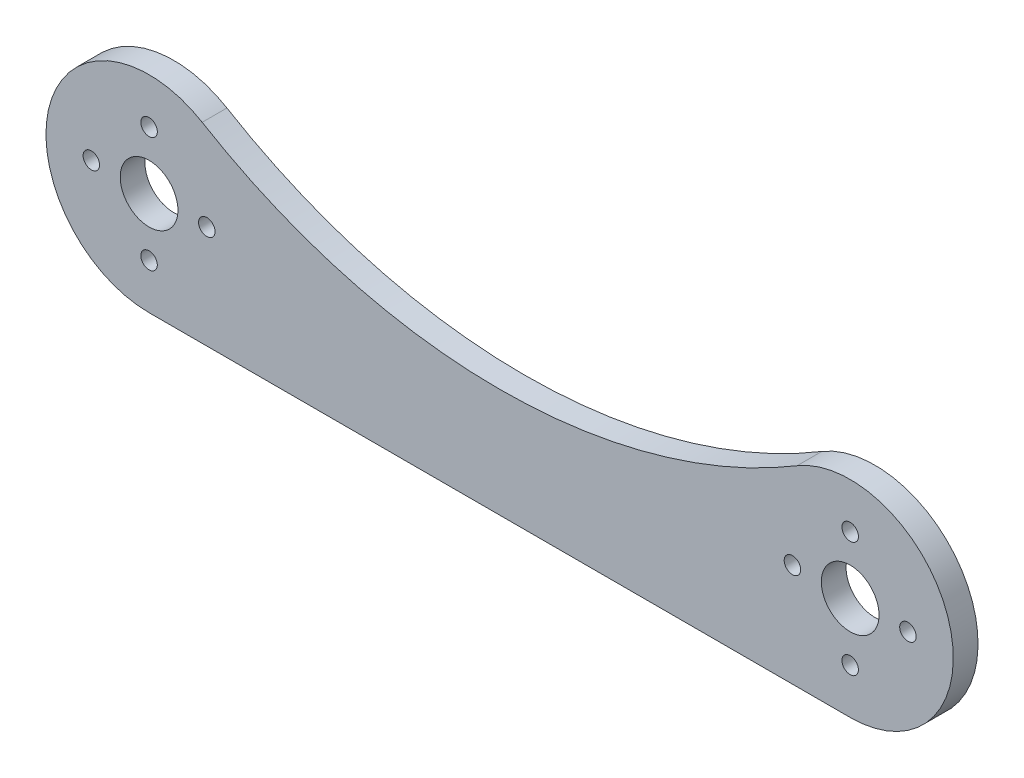
ISO-10303-21;
HEADER;
FILE_DESCRIPTION(('STEP AP214'),'2;1');
FILE_NAME('part.step','',(''),(''),'','','');
FILE_SCHEMA(('AUTOMOTIVE_DESIGN { 1 0 10303 214 1 1 1 1 }'));
ENDSEC;
DATA;
#1=APPLICATION_CONTEXT('core data for automotive mechanical design processes');
#2=APPLICATION_PROTOCOL_DEFINITION('international standard','automotive_design',2000,#1);
#3=PRODUCT_CONTEXT('',#1,'mechanical');
#4=PRODUCT('Part','Part','',(#3));
#5=PRODUCT_RELATED_PRODUCT_CATEGORY('part','',(#4));
#6=PRODUCT_DEFINITION_FORMATION('','',#4);
#7=PRODUCT_DEFINITION_CONTEXT('part definition',#1,'design');
#8=PRODUCT_DEFINITION('design','',#6,#7);
#9=PRODUCT_DEFINITION_SHAPE('','',#8);
#10=(LENGTH_UNIT() NAMED_UNIT(*) SI_UNIT(.MILLI.,.METRE.));
#11=(NAMED_UNIT(*) PLANE_ANGLE_UNIT() SI_UNIT($,.RADIAN.));
#12=(NAMED_UNIT(*) SI_UNIT($,.STERADIAN.) SOLID_ANGLE_UNIT());
#13=UNCERTAINTY_MEASURE_WITH_UNIT(LENGTH_MEASURE(1.E-05),#10,'distance_accuracy_value','');
#14=(GEOMETRIC_REPRESENTATION_CONTEXT(3) GLOBAL_UNCERTAINTY_ASSIGNED_CONTEXT((#13)) GLOBAL_UNIT_ASSIGNED_CONTEXT((#10,
#11,#12)) REPRESENTATION_CONTEXT('',''));
#15=CARTESIAN_POINT('',(0.,0.,0.));
#16=DIRECTION('',(0.,0.,1.));
#17=DIRECTION('',(1.,0.,0.));
#18=AXIS2_PLACEMENT_3D('',#15,#16,#17);
#19=CARTESIAN_POINT('',(-42.5,0.,3.));
#20=DIRECTION('',(0.,0.,1.));
#21=DIRECTION('',(1.,0.,0.));
#22=AXIS2_PLACEMENT_3D('',#19,#20,#21);
#23=PLANE('',#22);
#24=CARTESIAN_POINT('',(42.5,-6.99999999999999,3.));
#25=DIRECTION('',(0.,0.,1.));
#26=DIRECTION('',(1.,0.,0.));
#27=AXIS2_PLACEMENT_3D('',#24,#25,#26);
#28=CIRCLE('',#27,0.999999999999998);
#29=CARTESIAN_POINT('',(43.5,-6.99999999999999,3.));
#30=VERTEX_POINT('',#29);
#31=EDGE_CURVE('E158',#30,#30,#28,.T.);
#32=ORIENTED_EDGE('',*,*,#31,.F.);
#33=EDGE_LOOP('',(#32));
#34=FACE_BOUND('',#33,.T.);
#35=CARTESIAN_POINT('',(42.5,6.99999999999999,3.));
#36=DIRECTION('',(0.,0.,1.));
#37=DIRECTION('',(-1.,0.,0.));
#38=AXIS2_PLACEMENT_3D('',#35,#36,#37);
#39=CIRCLE('',#38,0.999999999999998);
#40=CARTESIAN_POINT('',(41.5,6.99999999999999,3.));
#41=VERTEX_POINT('',#40);
#42=EDGE_CURVE('E146',#41,#41,#39,.T.);
#43=ORIENTED_EDGE('',*,*,#42,.F.);
#44=EDGE_LOOP('',(#43));
#45=FACE_BOUND('',#44,.T.);
#46=CARTESIAN_POINT('',(-42.5,-6.99999999999999,3.));
#47=DIRECTION('',(0.,0.,1.));
#48=DIRECTION('',(-1.,0.,0.));
#49=AXIS2_PLACEMENT_3D('',#46,#47,#48);
#50=CIRCLE('',#49,0.999999999999998);
#51=CARTESIAN_POINT('',(-43.5,-6.99999999999999,3.));
#52=VERTEX_POINT('',#51);
#53=EDGE_CURVE('E134',#52,#52,#50,.T.);
#54=ORIENTED_EDGE('',*,*,#53,.F.);
#55=EDGE_LOOP('',(#54));
#56=FACE_BOUND('',#55,.T.);
#57=CARTESIAN_POINT('',(-42.5,6.99999999999999,3.));
#58=DIRECTION('',(0.,0.,1.));
#59=DIRECTION('',(1.,0.,0.));
#60=AXIS2_PLACEMENT_3D('',#57,#58,#59);
#61=CIRCLE('',#60,0.999999999999998);
#62=CARTESIAN_POINT('',(-41.5,6.99999999999999,3.));
#63=VERTEX_POINT('',#62);
#64=EDGE_CURVE('E122',#63,#63,#61,.T.);
#65=ORIENTED_EDGE('',*,*,#64,.F.);
#66=EDGE_LOOP('',(#65));
#67=FACE_BOUND('',#66,.T.);
#68=CARTESIAN_POINT('',(-42.5,0.,3.));
#69=DIRECTION('',(0.,0.,1.));
#70=DIRECTION('',(1.,0.,0.));
#71=AXIS2_PLACEMENT_3D('',#68,#69,#70);
#72=CIRCLE('',#71,3.5);
#73=CARTESIAN_POINT('',(-39.,0.,3.));
#74=VERTEX_POINT('',#73);
#75=EDGE_CURVE('E101',#74,#74,#72,.T.);
#76=ORIENTED_EDGE('',*,*,#75,.F.);
#77=EDGE_LOOP('',(#76));
#78=FACE_BOUND('',#77,.T.);
#79=CARTESIAN_POINT('',(-42.5,0.,3.));
#80=DIRECTION('',(0.,0.,1.));
#81=DIRECTION('',(1.,0.,0.));
#82=AXIS2_PLACEMENT_3D('',#79,#80,#81);
#83=CIRCLE('',#82,12.5);
#84=CARTESIAN_POINT('',(-36.0606060606061,10.7137391088871,3.));
#85=VERTEX_POINT('',#84);
#86=CARTESIAN_POINT('',(-42.5,-12.5,3.));
#87=VERTEX_POINT('',#86);
#88=EDGE_CURVE('E86',#85,#87,#83,.T.);
#89=ORIENTED_EDGE('',*,*,#88,.T.);
#90=DIRECTION('',(1.,0.,0.));
#91=VECTOR('',#90,1.);
#92=CARTESIAN_POINT('',(-42.5,-12.5,3.));
#93=LINE('',#92,#91);
#94=CARTESIAN_POINT('',(42.5,-12.5,3.));
#95=VERTEX_POINT('',#94);
#96=EDGE_CURVE('E81',#87,#95,#93,.T.);
#97=ORIENTED_EDGE('',*,*,#96,.T.);
#98=CARTESIAN_POINT('',(42.5,0.,3.));
#99=DIRECTION('',(0.,0.,1.));
#100=DIRECTION('',(1.,0.,0.));
#101=AXIS2_PLACEMENT_3D('',#98,#99,#100);
#102=CIRCLE('',#101,12.5);
#103=CARTESIAN_POINT('',(36.0606060606061,10.7137391088871,3.));
#104=VERTEX_POINT('',#103);
#105=EDGE_CURVE('E84',#95,#104,#102,.T.);
#106=ORIENTED_EDGE('',*,*,#105,.T.);
#107=CARTESIAN_POINT('',(0.,70.7106781186548,3.));
#108=DIRECTION('',(0.,0.,-1.));
#109=DIRECTION('',(1.,0.,0.));
#110=AXIS2_PLACEMENT_3D('',#107,#108,#109);
#111=CIRCLE('',#110,70.);
#112=EDGE_CURVE('E51',#104,#85,#111,.T.);
#113=ORIENTED_EDGE('',*,*,#112,.T.);
#114=EDGE_LOOP('',(#89,#97,#106,#113));
#115=FACE_BOUND('',#114,.T.);
#116=CARTESIAN_POINT('',(42.5,0.,3.));
#117=DIRECTION('',(0.,0.,1.));
#118=DIRECTION('',(1.,0.,0.));
#119=AXIS2_PLACEMENT_3D('',#116,#117,#118);
#120=CIRCLE('',#119,3.5);
#121=CARTESIAN_POINT('',(46.,0.,3.));
#122=VERTEX_POINT('',#121);
#123=EDGE_CURVE('E116',#122,#122,#120,.T.);
#124=ORIENTED_EDGE('',*,*,#123,.F.);
#125=EDGE_LOOP('',(#124));
#126=FACE_BOUND('',#125,.T.);
#127=CARTESIAN_POINT('',(-35.5,0.,3.));
#128=DIRECTION('',(0.,0.,1.));
#129=DIRECTION('',(1.,0.,0.));
#130=AXIS2_PLACEMENT_3D('',#127,#128,#129);
#131=CIRCLE('',#130,0.999999999999998);
#132=CARTESIAN_POINT('',(-34.5,0.,3.));
#133=VERTEX_POINT('',#132);
#134=EDGE_CURVE('E128',#133,#133,#131,.T.);
#135=ORIENTED_EDGE('',*,*,#134,.F.);
#136=EDGE_LOOP('',(#135));
#137=FACE_BOUND('',#136,.T.);
#138=CARTESIAN_POINT('',(-49.5,0.,3.));
#139=DIRECTION('',(0.,0.,1.));
#140=DIRECTION('',(-1.,0.,0.));
#141=AXIS2_PLACEMENT_3D('',#138,#139,#140);
#142=CIRCLE('',#141,0.999999999999998);
#143=CARTESIAN_POINT('',(-50.5,0.,3.));
#144=VERTEX_POINT('',#143);
#145=EDGE_CURVE('E140',#144,#144,#142,.T.);
#146=ORIENTED_EDGE('',*,*,#145,.F.);
#147=EDGE_LOOP('',(#146));
#148=FACE_BOUND('',#147,.T.);
#149=CARTESIAN_POINT('',(35.5,0.,3.));
#150=DIRECTION('',(0.,0.,1.));
#151=DIRECTION('',(-1.,0.,0.));
#152=AXIS2_PLACEMENT_3D('',#149,#150,#151);
#153=CIRCLE('',#152,0.999999999999998);
#154=CARTESIAN_POINT('',(34.5,0.,3.));
#155=VERTEX_POINT('',#154);
#156=EDGE_CURVE('E152',#155,#155,#153,.T.);
#157=ORIENTED_EDGE('',*,*,#156,.F.);
#158=EDGE_LOOP('',(#157));
#159=FACE_BOUND('',#158,.T.);
#160=CARTESIAN_POINT('',(49.5,0.,3.));
#161=DIRECTION('',(0.,0.,1.));
#162=DIRECTION('',(1.,0.,0.));
#163=AXIS2_PLACEMENT_3D('',#160,#161,#162);
#164=CIRCLE('',#163,0.999999999999998);
#165=CARTESIAN_POINT('',(50.5,0.,3.));
#166=VERTEX_POINT('',#165);
#167=EDGE_CURVE('E164',#166,#166,#164,.T.);
#168=ORIENTED_EDGE('',*,*,#167,.F.);
#169=EDGE_LOOP('',(#168));
#170=FACE_BOUND('',#169,.T.);
#171=ADVANCED_FACE('F34',(#34,#45,#56,#67,#78,#115,#126,#137,#148,#159,#170),#23,.T.);
#172=CARTESIAN_POINT('',(-42.5,0.,0.));
#173=DIRECTION('',(0.,0.,1.));
#174=DIRECTION('',(1.,0.,0.));
#175=AXIS2_PLACEMENT_3D('',#172,#173,#174);
#176=PLANE('',#175);
#177=CARTESIAN_POINT('',(-42.5,0.,0.));
#178=DIRECTION('',(0.,0.,1.));
#179=DIRECTION('',(1.,0.,0.));
#180=AXIS2_PLACEMENT_3D('',#177,#178,#179);
#181=CIRCLE('',#180,12.5);
#182=CARTESIAN_POINT('',(-36.0606060606061,10.7137391088871,0.));
#183=VERTEX_POINT('',#182);
#184=CARTESIAN_POINT('',(-42.5,-12.5,0.));
#185=VERTEX_POINT('',#184);
#186=EDGE_CURVE('E98',#183,#185,#181,.T.);
#187=ORIENTED_EDGE('',*,*,#186,.F.);
#188=CARTESIAN_POINT('',(0.,70.7106781186548,0.));
#189=DIRECTION('',(0.,0.,-1.));
#190=DIRECTION('',(1.,0.,0.));
#191=AXIS2_PLACEMENT_3D('',#188,#189,#190);
#192=CIRCLE('',#191,70.);
#193=CARTESIAN_POINT('',(36.0606060606061,10.7137391088871,0.));
#194=VERTEX_POINT('',#193);
#195=EDGE_CURVE('E74',#194,#183,#192,.T.);
#196=ORIENTED_EDGE('',*,*,#195,.F.);
#197=CARTESIAN_POINT('',(42.5,0.,0.));
#198=DIRECTION('',(0.,0.,1.));
#199=DIRECTION('',(1.,0.,0.));
#200=AXIS2_PLACEMENT_3D('',#197,#198,#199);
#201=CIRCLE('',#200,12.5);
#202=CARTESIAN_POINT('',(42.5,-12.5,0.));
#203=VERTEX_POINT('',#202);
#204=EDGE_CURVE('E68',#203,#194,#201,.T.);
#205=ORIENTED_EDGE('',*,*,#204,.F.);
#206=DIRECTION('',(1.,0.,0.));
#207=VECTOR('',#206,1.);
#208=CARTESIAN_POINT('',(-42.5,-12.5,0.));
#209=LINE('',#208,#207);
#210=EDGE_CURVE('E90',#185,#203,#209,.T.);
#211=ORIENTED_EDGE('',*,*,#210,.F.);
#212=EDGE_LOOP('',(#187,#196,#205,#211));
#213=FACE_BOUND('',#212,.T.);
#214=CARTESIAN_POINT('',(-42.5,0.,0.));
#215=DIRECTION('',(0.,0.,1.));
#216=DIRECTION('',(1.,0.,0.));
#217=AXIS2_PLACEMENT_3D('',#214,#215,#216);
#218=CIRCLE('',#217,3.5);
#219=CARTESIAN_POINT('',(-39.,0.,0.));
#220=VERTEX_POINT('',#219);
#221=EDGE_CURVE('E113',#220,#220,#218,.T.);
#222=ORIENTED_EDGE('',*,*,#221,.T.);
#223=EDGE_LOOP('',(#222));
#224=FACE_BOUND('',#223,.T.);
#225=CARTESIAN_POINT('',(42.5,0.,0.));
#226=DIRECTION('',(0.,0.,1.));
#227=DIRECTION('',(1.,0.,0.));
#228=AXIS2_PLACEMENT_3D('',#225,#226,#227);
#229=CIRCLE('',#228,3.5);
#230=CARTESIAN_POINT('',(46.,0.,0.));
#231=VERTEX_POINT('',#230);
#232=EDGE_CURVE('E119',#231,#231,#229,.T.);
#233=ORIENTED_EDGE('',*,*,#232,.T.);
#234=EDGE_LOOP('',(#233));
#235=FACE_BOUND('',#234,.T.);
#236=CARTESIAN_POINT('',(-42.5,6.99999999999999,0.));
#237=DIRECTION('',(0.,0.,1.));
#238=DIRECTION('',(1.,0.,0.));
#239=AXIS2_PLACEMENT_3D('',#236,#237,#238);
#240=CIRCLE('',#239,0.999999999999998);
#241=CARTESIAN_POINT('',(-41.5,6.99999999999999,0.));
#242=VERTEX_POINT('',#241);
#243=EDGE_CURVE('E125',#242,#242,#240,.T.);
#244=ORIENTED_EDGE('',*,*,#243,.T.);
#245=EDGE_LOOP('',(#244));
#246=FACE_BOUND('',#245,.T.);
#247=CARTESIAN_POINT('',(-35.5,0.,0.));
#248=DIRECTION('',(0.,0.,1.));
#249=DIRECTION('',(1.,0.,0.));
#250=AXIS2_PLACEMENT_3D('',#247,#248,#249);
#251=CIRCLE('',#250,0.999999999999998);
#252=CARTESIAN_POINT('',(-34.5,0.,0.));
#253=VERTEX_POINT('',#252);
#254=EDGE_CURVE('E131',#253,#253,#251,.T.);
#255=ORIENTED_EDGE('',*,*,#254,.T.);
#256=EDGE_LOOP('',(#255));
#257=FACE_BOUND('',#256,.T.);
#258=CARTESIAN_POINT('',(-42.5,-6.99999999999999,0.));
#259=DIRECTION('',(0.,0.,1.));
#260=DIRECTION('',(-1.,0.,0.));
#261=AXIS2_PLACEMENT_3D('',#258,#259,#260);
#262=CIRCLE('',#261,0.999999999999998);
#263=CARTESIAN_POINT('',(-43.5,-6.99999999999999,0.));
#264=VERTEX_POINT('',#263);
#265=EDGE_CURVE('E137',#264,#264,#262,.T.);
#266=ORIENTED_EDGE('',*,*,#265,.T.);
#267=EDGE_LOOP('',(#266));
#268=FACE_BOUND('',#267,.T.);
#269=CARTESIAN_POINT('',(-49.5,0.,0.));
#270=DIRECTION('',(0.,0.,1.));
#271=DIRECTION('',(-1.,0.,0.));
#272=AXIS2_PLACEMENT_3D('',#269,#270,#271);
#273=CIRCLE('',#272,0.999999999999998);
#274=CARTESIAN_POINT('',(-50.5,0.,0.));
#275=VERTEX_POINT('',#274);
#276=EDGE_CURVE('E143',#275,#275,#273,.T.);
#277=ORIENTED_EDGE('',*,*,#276,.T.);
#278=EDGE_LOOP('',(#277));
#279=FACE_BOUND('',#278,.T.);
#280=CARTESIAN_POINT('',(42.5,6.99999999999999,0.));
#281=DIRECTION('',(0.,0.,1.));
#282=DIRECTION('',(-1.,0.,0.));
#283=AXIS2_PLACEMENT_3D('',#280,#281,#282);
#284=CIRCLE('',#283,0.999999999999998);
#285=CARTESIAN_POINT('',(41.5,6.99999999999999,0.));
#286=VERTEX_POINT('',#285);
#287=EDGE_CURVE('E149',#286,#286,#284,.T.);
#288=ORIENTED_EDGE('',*,*,#287,.T.);
#289=EDGE_LOOP('',(#288));
#290=FACE_BOUND('',#289,.T.);
#291=CARTESIAN_POINT('',(35.5,0.,0.));
#292=DIRECTION('',(0.,0.,1.));
#293=DIRECTION('',(-1.,0.,0.));
#294=AXIS2_PLACEMENT_3D('',#291,#292,#293);
#295=CIRCLE('',#294,0.999999999999998);
#296=CARTESIAN_POINT('',(34.5,0.,0.));
#297=VERTEX_POINT('',#296);
#298=EDGE_CURVE('E155',#297,#297,#295,.T.);
#299=ORIENTED_EDGE('',*,*,#298,.T.);
#300=EDGE_LOOP('',(#299));
#301=FACE_BOUND('',#300,.T.);
#302=CARTESIAN_POINT('',(42.5,-6.99999999999999,0.));
#303=DIRECTION('',(0.,0.,1.));
#304=DIRECTION('',(1.,0.,0.));
#305=AXIS2_PLACEMENT_3D('',#302,#303,#304);
#306=CIRCLE('',#305,0.999999999999998);
#307=CARTESIAN_POINT('',(43.5,-6.99999999999999,0.));
#308=VERTEX_POINT('',#307);
#309=EDGE_CURVE('E161',#308,#308,#306,.T.);
#310=ORIENTED_EDGE('',*,*,#309,.T.);
#311=EDGE_LOOP('',(#310));
#312=FACE_BOUND('',#311,.T.);
#313=CARTESIAN_POINT('',(49.5,0.,0.));
#314=DIRECTION('',(0.,0.,1.));
#315=DIRECTION('',(1.,0.,0.));
#316=AXIS2_PLACEMENT_3D('',#313,#314,#315);
#317=CIRCLE('',#316,0.999999999999998);
#318=CARTESIAN_POINT('',(50.5,0.,0.));
#319=VERTEX_POINT('',#318);
#320=EDGE_CURVE('E167',#319,#319,#317,.T.);
#321=ORIENTED_EDGE('',*,*,#320,.T.);
#322=EDGE_LOOP('',(#321));
#323=FACE_BOUND('',#322,.T.);
#324=ADVANCED_FACE('F109',(#213,#224,#235,#246,#257,#268,#279,#290,#301,#312,#323),#176,.F.);
#325=CARTESIAN_POINT('',(-42.5,0.,3.));
#326=DIRECTION('',(0.,0.,-1.));
#327=DIRECTION('',(-1.,0.,0.));
#328=AXIS2_PLACEMENT_3D('',#325,#326,#327);
#329=CYLINDRICAL_SURFACE('',#328,12.5);
#330=ORIENTED_EDGE('',*,*,#186,.T.);
#331=DIRECTION('',(0.,0.,-1.));
#332=VECTOR('',#331,1.);
#333=CARTESIAN_POINT('',(-42.5,-12.5,3.));
#334=LINE('',#333,#332);
#335=EDGE_CURVE('E11',#87,#185,#334,.T.);
#336=ORIENTED_EDGE('',*,*,#335,.F.);
#337=ORIENTED_EDGE('',*,*,#88,.F.);
#338=DIRECTION('',(0.,0.,-1.));
#339=VECTOR('',#338,1.);
#340=CARTESIAN_POINT('',(-36.0606060606061,10.7137391088871,3.));
#341=LINE('',#340,#339);
#342=EDGE_CURVE('E94',#85,#183,#341,.T.);
#343=ORIENTED_EDGE('',*,*,#342,.T.);
#344=EDGE_LOOP('',(#330,#336,#337,#343));
#345=FACE_BOUND('',#344,.T.);
#346=ADVANCED_FACE('F36',(#345),#329,.T.);
#347=CARTESIAN_POINT('',(-42.5,-12.5,3.));
#348=DIRECTION('',(0.,1.,0.));
#349=DIRECTION('',(0.,0.,1.));
#350=AXIS2_PLACEMENT_3D('',#347,#348,#349);
#351=PLANE('',#350);
#352=ORIENTED_EDGE('',*,*,#210,.T.);
#353=DIRECTION('',(0.,0.,-1.));
#354=VECTOR('',#353,1.);
#355=CARTESIAN_POINT('',(42.5,-12.5,3.));
#356=LINE('',#355,#354);
#357=EDGE_CURVE('E43',#95,#203,#356,.T.);
#358=ORIENTED_EDGE('',*,*,#357,.F.);
#359=ORIENTED_EDGE('',*,*,#96,.F.);
#360=ORIENTED_EDGE('',*,*,#335,.T.);
#361=EDGE_LOOP('',(#352,#358,#359,#360));
#362=FACE_BOUND('',#361,.T.);
#363=ADVANCED_FACE('F89',(#362),#351,.F.);
#364=CARTESIAN_POINT('',(42.5,0.,3.));
#365=DIRECTION('',(0.,0.,-1.));
#366=DIRECTION('',(-1.,0.,0.));
#367=AXIS2_PLACEMENT_3D('',#364,#365,#366);
#368=CYLINDRICAL_SURFACE('',#367,12.5);
#369=ORIENTED_EDGE('',*,*,#204,.T.);
#370=DIRECTION('',(0.,0.,-1.));
#371=VECTOR('',#370,1.);
#372=CARTESIAN_POINT('',(36.0606060606061,10.7137391088871,3.));
#373=LINE('',#372,#371);
#374=EDGE_CURVE('E91',#104,#194,#373,.T.);
#375=ORIENTED_EDGE('',*,*,#374,.F.);
#376=ORIENTED_EDGE('',*,*,#105,.F.);
#377=ORIENTED_EDGE('',*,*,#357,.T.);
#378=EDGE_LOOP('',(#369,#375,#376,#377));
#379=FACE_BOUND('',#378,.T.);
#380=ADVANCED_FACE('F92',(#379),#368,.T.);
#381=CARTESIAN_POINT('',(0.,70.7106781186548,3.));
#382=DIRECTION('',(0.,0.,-1.));
#383=DIRECTION('',(-1.,0.,0.));
#384=AXIS2_PLACEMENT_3D('',#381,#382,#383);
#385=CYLINDRICAL_SURFACE('',#384,70.);
#386=ORIENTED_EDGE('',*,*,#195,.T.);
#387=ORIENTED_EDGE('',*,*,#342,.F.);
#388=ORIENTED_EDGE('',*,*,#112,.F.);
#389=ORIENTED_EDGE('',*,*,#374,.T.);
#390=EDGE_LOOP('',(#386,#387,#388,#389));
#391=FACE_BOUND('',#390,.T.);
#392=ADVANCED_FACE('F106',(#391),#385,.F.);
#393=CARTESIAN_POINT('',(-42.5,0.,3.));
#394=DIRECTION('',(0.,0.,-1.));
#395=DIRECTION('',(-1.,0.,0.));
#396=AXIS2_PLACEMENT_3D('',#393,#394,#395);
#397=CYLINDRICAL_SURFACE('',#396,3.5);
#398=ORIENTED_EDGE('',*,*,#75,.T.);
#399=EDGE_LOOP('',(#398));
#400=FACE_BOUND('',#399,.T.);
#401=ORIENTED_EDGE('',*,*,#221,.F.);
#402=EDGE_LOOP('',(#401));
#403=FACE_BOUND('',#402,.T.);
#404=ADVANCED_FACE('F186',(#400,#403),#397,.F.);
#405=CARTESIAN_POINT('',(42.5,0.,3.));
#406=DIRECTION('',(0.,0.,-1.));
#407=DIRECTION('',(-1.,0.,0.));
#408=AXIS2_PLACEMENT_3D('',#405,#406,#407);
#409=CYLINDRICAL_SURFACE('',#408,3.5);
#410=ORIENTED_EDGE('',*,*,#123,.T.);
#411=EDGE_LOOP('',(#410));
#412=FACE_BOUND('',#411,.T.);
#413=ORIENTED_EDGE('',*,*,#232,.F.);
#414=EDGE_LOOP('',(#413));
#415=FACE_BOUND('',#414,.T.);
#416=ADVANCED_FACE('F232',(#412,#415),#409,.F.);
#417=CARTESIAN_POINT('',(-42.5,6.99999999999999,3.));
#418=DIRECTION('',(0.,0.,-1.));
#419=DIRECTION('',(-1.,0.,0.));
#420=AXIS2_PLACEMENT_3D('',#417,#418,#419);
#421=CYLINDRICAL_SURFACE('',#420,0.999999999999998);
#422=ORIENTED_EDGE('',*,*,#64,.T.);
#423=EDGE_LOOP('',(#422));
#424=FACE_BOUND('',#423,.T.);
#425=ORIENTED_EDGE('',*,*,#243,.F.);
#426=EDGE_LOOP('',(#425));
#427=FACE_BOUND('',#426,.T.);
#428=ADVANCED_FACE('F240',(#424,#427),#421,.F.);
#429=CARTESIAN_POINT('',(-35.5,0.,3.));
#430=DIRECTION('',(0.,0.,-1.));
#431=DIRECTION('',(-1.,0.,0.));
#432=AXIS2_PLACEMENT_3D('',#429,#430,#431);
#433=CYLINDRICAL_SURFACE('',#432,0.999999999999998);
#434=ORIENTED_EDGE('',*,*,#134,.T.);
#435=EDGE_LOOP('',(#434));
#436=FACE_BOUND('',#435,.T.);
#437=ORIENTED_EDGE('',*,*,#254,.F.);
#438=EDGE_LOOP('',(#437));
#439=FACE_BOUND('',#438,.T.);
#440=ADVANCED_FACE('F248',(#436,#439),#433,.F.);
#441=CARTESIAN_POINT('',(-42.5,-6.99999999999999,3.));
#442=DIRECTION('',(0.,0.,-1.));
#443=DIRECTION('',(-1.,0.,0.));
#444=AXIS2_PLACEMENT_3D('',#441,#442,#443);
#445=CYLINDRICAL_SURFACE('',#444,0.999999999999998);
#446=ORIENTED_EDGE('',*,*,#53,.T.);
#447=EDGE_LOOP('',(#446));
#448=FACE_BOUND('',#447,.T.);
#449=ORIENTED_EDGE('',*,*,#265,.F.);
#450=EDGE_LOOP('',(#449));
#451=FACE_BOUND('',#450,.T.);
#452=ADVANCED_FACE('F257',(#448,#451),#445,.F.);
#453=CARTESIAN_POINT('',(-49.5,0.,3.));
#454=DIRECTION('',(0.,0.,-1.));
#455=DIRECTION('',(-1.,0.,0.));
#456=AXIS2_PLACEMENT_3D('',#453,#454,#455);
#457=CYLINDRICAL_SURFACE('',#456,0.999999999999998);
#458=ORIENTED_EDGE('',*,*,#145,.T.);
#459=EDGE_LOOP('',(#458));
#460=FACE_BOUND('',#459,.T.);
#461=ORIENTED_EDGE('',*,*,#276,.F.);
#462=EDGE_LOOP('',(#461));
#463=FACE_BOUND('',#462,.T.);
#464=ADVANCED_FACE('F266',(#460,#463),#457,.F.);
#465=CARTESIAN_POINT('',(42.5,6.99999999999999,3.));
#466=DIRECTION('',(0.,0.,-1.));
#467=DIRECTION('',(-1.,0.,0.));
#468=AXIS2_PLACEMENT_3D('',#465,#466,#467);
#469=CYLINDRICAL_SURFACE('',#468,0.999999999999998);
#470=ORIENTED_EDGE('',*,*,#42,.T.);
#471=EDGE_LOOP('',(#470));
#472=FACE_BOUND('',#471,.T.);
#473=ORIENTED_EDGE('',*,*,#287,.F.);
#474=EDGE_LOOP('',(#473));
#475=FACE_BOUND('',#474,.T.);
#476=ADVANCED_FACE('F275',(#472,#475),#469,.F.);
#477=CARTESIAN_POINT('',(35.5,0.,3.));
#478=DIRECTION('',(0.,0.,-1.));
#479=DIRECTION('',(-1.,0.,0.));
#480=AXIS2_PLACEMENT_3D('',#477,#478,#479);
#481=CYLINDRICAL_SURFACE('',#480,0.999999999999998);
#482=ORIENTED_EDGE('',*,*,#156,.T.);
#483=EDGE_LOOP('',(#482));
#484=FACE_BOUND('',#483,.T.);
#485=ORIENTED_EDGE('',*,*,#298,.F.);
#486=EDGE_LOOP('',(#485));
#487=FACE_BOUND('',#486,.T.);
#488=ADVANCED_FACE('F284',(#484,#487),#481,.F.);
#489=CARTESIAN_POINT('',(42.5,-6.99999999999999,3.));
#490=DIRECTION('',(0.,0.,-1.));
#491=DIRECTION('',(-1.,0.,0.));
#492=AXIS2_PLACEMENT_3D('',#489,#490,#491);
#493=CYLINDRICAL_SURFACE('',#492,0.999999999999998);
#494=ORIENTED_EDGE('',*,*,#31,.T.);
#495=EDGE_LOOP('',(#494));
#496=FACE_BOUND('',#495,.T.);
#497=ORIENTED_EDGE('',*,*,#309,.F.);
#498=EDGE_LOOP('',(#497));
#499=FACE_BOUND('',#498,.T.);
#500=ADVANCED_FACE('F293',(#496,#499),#493,.F.);
#501=CARTESIAN_POINT('',(49.5,0.,3.));
#502=DIRECTION('',(0.,0.,-1.));
#503=DIRECTION('',(-1.,0.,0.));
#504=AXIS2_PLACEMENT_3D('',#501,#502,#503);
#505=CYLINDRICAL_SURFACE('',#504,0.999999999999998);
#506=ORIENTED_EDGE('',*,*,#167,.T.);
#507=EDGE_LOOP('',(#506));
#508=FACE_BOUND('',#507,.T.);
#509=ORIENTED_EDGE('',*,*,#320,.F.);
#510=EDGE_LOOP('',(#509));
#511=FACE_BOUND('',#510,.T.);
#512=ADVANCED_FACE('F173',(#508,#511),#505,.F.);
#513=CLOSED_SHELL('',(#171,#324,#346,#363,#380,#392,#404,#416,#428,#440,#452,#464,#476,#488,
#500,#512));
#514=MANIFOLD_SOLID_BREP('B2',#513);
#515=ADVANCED_BREP_SHAPE_REPRESENTATION('',(#18,#514),#14);
#516=SHAPE_DEFINITION_REPRESENTATION(#9,#515);
ENDSEC;
END-ISO-10303-21;
